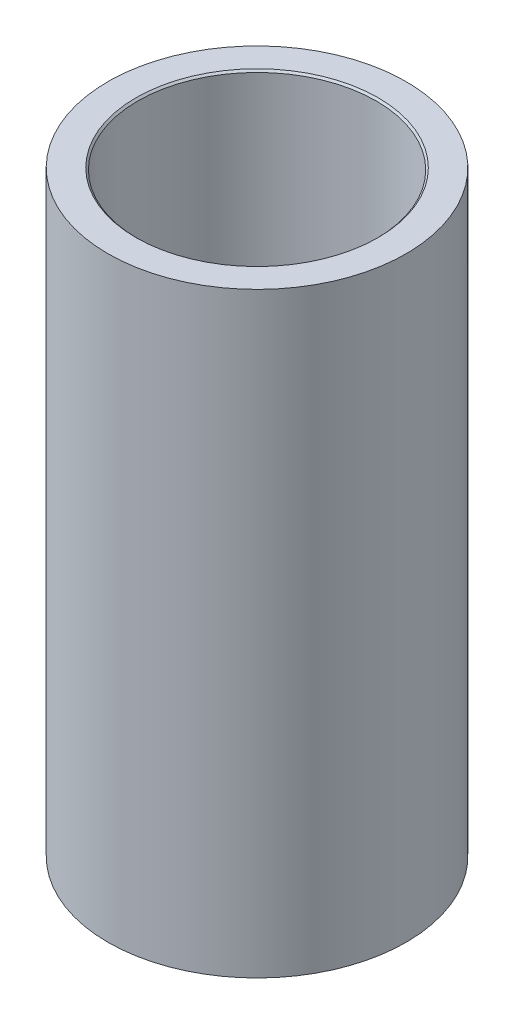
ISO-10303-21;
HEADER;
FILE_DESCRIPTION(('STEP AP214'),'2;1');
FILE_NAME('part.step','',(''),(''),'','','');
FILE_SCHEMA(('AUTOMOTIVE_DESIGN { 1 0 10303 214 1 1 1 1 }'));
ENDSEC;
DATA;
#1=APPLICATION_CONTEXT('core data for automotive mechanical design processes');
#2=APPLICATION_PROTOCOL_DEFINITION('international standard','automotive_design',2000,#1);
#3=PRODUCT_CONTEXT('',#1,'mechanical');
#4=PRODUCT('Part','Part','',(#3));
#5=PRODUCT_RELATED_PRODUCT_CATEGORY('part','',(#4));
#6=PRODUCT_DEFINITION_FORMATION('','',#4);
#7=PRODUCT_DEFINITION_CONTEXT('part definition',#1,'design');
#8=PRODUCT_DEFINITION('design','',#6,#7);
#9=PRODUCT_DEFINITION_SHAPE('','',#8);
#10=(LENGTH_UNIT() NAMED_UNIT(*) SI_UNIT(.MILLI.,.METRE.));
#11=(NAMED_UNIT(*) PLANE_ANGLE_UNIT() SI_UNIT($,.RADIAN.));
#12=(NAMED_UNIT(*) SI_UNIT($,.STERADIAN.) SOLID_ANGLE_UNIT());
#13=UNCERTAINTY_MEASURE_WITH_UNIT(LENGTH_MEASURE(1.E-05),#10,'distance_accuracy_value','');
#14=(GEOMETRIC_REPRESENTATION_CONTEXT(3) GLOBAL_UNCERTAINTY_ASSIGNED_CONTEXT((#13)) GLOBAL_UNIT_ASSIGNED_CONTEXT((#10,
#11,#12)) REPRESENTATION_CONTEXT('',''));
#15=CARTESIAN_POINT('',(0.,0.,0.));
#16=DIRECTION('',(0.,0.,1.));
#17=DIRECTION('',(1.,0.,0.));
#18=AXIS2_PLACEMENT_3D('',#15,#16,#17);
#19=CARTESIAN_POINT('',(0.,8.,0.));
#20=DIRECTION('',(0.,-1.,0.));
#21=DIRECTION('',(0.,0.,-1.));
#22=AXIS2_PLACEMENT_3D('',#19,#20,#21);
#23=CYLINDRICAL_SURFACE('',#22,2.);
#24=CARTESIAN_POINT('',(0.,8.,0.));
#25=DIRECTION('',(0.,1.,0.));
#26=DIRECTION('',(0.,0.,1.));
#27=AXIS2_PLACEMENT_3D('',#24,#25,#26);
#28=CIRCLE('',#27,2.);
#29=CARTESIAN_POINT('',(0.,8.,2.));
#30=VERTEX_POINT('',#29);
#31=EDGE_CURVE('E10',#30,#30,#28,.T.);
#32=ORIENTED_EDGE('',*,*,#31,.F.);
#33=EDGE_LOOP('',(#32));
#34=FACE_BOUND('',#33,.T.);
#35=CARTESIAN_POINT('',(0.,0.,0.));
#36=DIRECTION('',(0.,1.,0.));
#37=DIRECTION('',(0.,0.,1.));
#38=AXIS2_PLACEMENT_3D('',#35,#36,#37);
#39=CIRCLE('',#38,2.);
#40=CARTESIAN_POINT('',(0.,0.,2.));
#41=VERTEX_POINT('',#40);
#42=EDGE_CURVE('E35',#41,#41,#39,.T.);
#43=ORIENTED_EDGE('',*,*,#42,.T.);
#44=EDGE_LOOP('',(#43));
#45=FACE_BOUND('',#44,.T.);
#46=ADVANCED_FACE('F32',(#34,#45),#23,.T.);
#47=CARTESIAN_POINT('',(0.,8.,0.));
#48=DIRECTION('',(0.,1.,0.));
#49=DIRECTION('',(0.,0.,1.));
#50=AXIS2_PLACEMENT_3D('',#47,#48,#49);
#51=PLANE('',#50);
#52=CARTESIAN_POINT('',(0.,8.,0.));
#53=DIRECTION('',(0.,1.,0.));
#54=DIRECTION('',(0.,0.,1.));
#55=AXIS2_PLACEMENT_3D('',#52,#53,#54);
#56=CIRCLE('',#55,1.625);
#57=CARTESIAN_POINT('',(0.,8.,1.625));
#58=VERTEX_POINT('',#57);
#59=EDGE_CURVE('E49',#58,#58,#56,.T.);
#60=ORIENTED_EDGE('',*,*,#59,.F.);
#61=EDGE_LOOP('',(#60));
#62=FACE_BOUND('',#61,.T.);
#63=ORIENTED_EDGE('',*,*,#31,.T.);
#64=EDGE_LOOP('',(#63));
#65=FACE_BOUND('',#64,.T.);
#66=ADVANCED_FACE('F55',(#62,#65),#51,.T.);
#67=CARTESIAN_POINT('',(0.,0.,0.));
#68=DIRECTION('',(0.,1.,0.));
#69=DIRECTION('',(0.,0.,1.));
#70=AXIS2_PLACEMENT_3D('',#67,#68,#69);
#71=PLANE('',#70);
#72=CARTESIAN_POINT('',(0.,0.,0.));
#73=DIRECTION('',(0.,1.,0.));
#74=DIRECTION('',(0.,0.,1.));
#75=AXIS2_PLACEMENT_3D('',#72,#73,#74);
#76=CIRCLE('',#75,1.6);
#77=CARTESIAN_POINT('',(0.,0.,1.6));
#78=VERTEX_POINT('',#77);
#79=EDGE_CURVE('E42',#78,#78,#76,.T.);
#80=ORIENTED_EDGE('',*,*,#79,.T.);
#81=EDGE_LOOP('',(#80));
#82=FACE_BOUND('',#81,.T.);
#83=ORIENTED_EDGE('',*,*,#42,.F.);
#84=EDGE_LOOP('',(#83));
#85=FACE_BOUND('',#84,.T.);
#86=ADVANCED_FACE('F57',(#82,#85),#71,.F.);
#87=CARTESIAN_POINT('',(0.,8.,0.));
#88=DIRECTION('',(0.,1.,0.));
#89=DIRECTION('',(0.,0.,1.));
#90=AXIS2_PLACEMENT_3D('',#87,#88,#89);
#91=CYLINDRICAL_SURFACE('',#90,1.6);
#92=ORIENTED_EDGE('',*,*,#79,.F.);
#93=EDGE_LOOP('',(#92));
#94=FACE_BOUND('',#93,.T.);
#95=CARTESIAN_POINT('',(0.,7.975,0.));
#96=DIRECTION('',(0.,1.,0.));
#97=DIRECTION('',(0.,0.,1.));
#98=AXIS2_PLACEMENT_3D('',#95,#96,#97);
#99=CIRCLE('',#98,1.6);
#100=CARTESIAN_POINT('',(0.,7.975,1.6));
#101=VERTEX_POINT('',#100);
#102=EDGE_CURVE('E46',#101,#101,#99,.T.);
#103=ORIENTED_EDGE('',*,*,#102,.T.);
#104=EDGE_LOOP('',(#103));
#105=FACE_BOUND('',#104,.T.);
#106=ADVANCED_FACE('F63',(#94,#105),#91,.F.);
#107=CARTESIAN_POINT('',(0.,8.,0.));
#108=DIRECTION('',(0.,1.,0.));
#109=DIRECTION('',(0.,0.,1.));
#110=AXIS2_PLACEMENT_3D('',#107,#108,#109);
#111=CONICAL_SURFACE('',#110,1.625,0.785398163397435);
#112=ORIENTED_EDGE('',*,*,#102,.F.);
#113=EDGE_LOOP('',(#112));
#114=FACE_BOUND('',#113,.T.);
#115=ORIENTED_EDGE('',*,*,#59,.T.);
#116=EDGE_LOOP('',(#115));
#117=FACE_BOUND('',#116,.T.);
#118=ADVANCED_FACE('F53',(#114,#117),#111,.F.);
#119=CLOSED_SHELL('',(#46,#66,#86,#106,#118));
#120=MANIFOLD_SOLID_BREP('B2',#119);
#121=ADVANCED_BREP_SHAPE_REPRESENTATION('',(#18,#120),#14);
#122=SHAPE_DEFINITION_REPRESENTATION(#9,#121);
ENDSEC;
END-ISO-10303-21;
